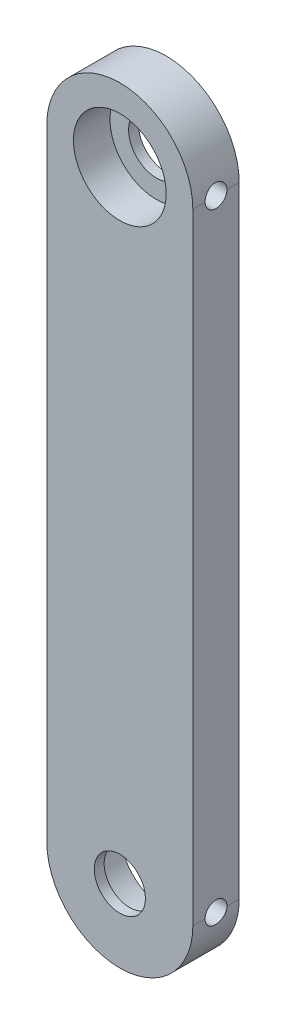
ISO-10303-21;
HEADER;
FILE_DESCRIPTION(('STEP AP214'),'2;1');
FILE_NAME('part.step','',(''),(''),'','','');
FILE_SCHEMA(('AUTOMOTIVE_DESIGN { 1 0 10303 214 1 1 1 1 }'));
ENDSEC;
DATA;
#1=APPLICATION_CONTEXT('core data for automotive mechanical design processes');
#2=APPLICATION_PROTOCOL_DEFINITION('international standard','automotive_design',2000,#1);
#3=PRODUCT_CONTEXT('',#1,'mechanical');
#4=PRODUCT('Part','Part','',(#3));
#5=PRODUCT_RELATED_PRODUCT_CATEGORY('part','',(#4));
#6=PRODUCT_DEFINITION_FORMATION('','',#4);
#7=PRODUCT_DEFINITION_CONTEXT('part definition',#1,'design');
#8=PRODUCT_DEFINITION('design','',#6,#7);
#9=PRODUCT_DEFINITION_SHAPE('','',#8);
#10=(LENGTH_UNIT() NAMED_UNIT(*) SI_UNIT(.MILLI.,.METRE.));
#11=(NAMED_UNIT(*) PLANE_ANGLE_UNIT() SI_UNIT($,.RADIAN.));
#12=(NAMED_UNIT(*) SI_UNIT($,.STERADIAN.) SOLID_ANGLE_UNIT());
#13=UNCERTAINTY_MEASURE_WITH_UNIT(LENGTH_MEASURE(1.E-05),#10,'distance_accuracy_value','');
#14=(GEOMETRIC_REPRESENTATION_CONTEXT(3) GLOBAL_UNCERTAINTY_ASSIGNED_CONTEXT((#13)) GLOBAL_UNIT_ASSIGNED_CONTEXT((#10,
#11,#12)) REPRESENTATION_CONTEXT('',''));
#15=CARTESIAN_POINT('',(0.,0.,0.));
#16=DIRECTION('',(0.,0.,1.));
#17=DIRECTION('',(1.,0.,0.));
#18=AXIS2_PLACEMENT_3D('',#15,#16,#17);
#19=CARTESIAN_POINT('',(0.,42.5,6.35));
#20=DIRECTION('',(0.,0.,-1.));
#21=DIRECTION('',(-1.,0.,0.));
#22=AXIS2_PLACEMENT_3D('',#19,#20,#21);
#23=CYLINDRICAL_SURFACE('',#22,10.);
#24=DIRECTION('',(0.,0.,-1.));
#25=VECTOR('',#24,1.);
#26=CARTESIAN_POINT('',(10.,42.5,6.35));
#27=LINE('',#26,#25);
#28=CARTESIAN_POINT('',(10.,42.5,6.35));
#29=VERTEX_POINT('',#28);
#30=CARTESIAN_POINT('',(10.,42.5,4.675));
#31=VERTEX_POINT('',#30);
#32=EDGE_CURVE('E116',#29,#31,#27,.T.);
#33=ORIENTED_EDGE('',*,*,#32,.T.);
#34=CARTESIAN_POINT('',(10.,42.5,4.675));
#35=CARTESIAN_POINT('',(10.0000014685064,42.5419508736504,4.67499999537497));
#36=CARTESIAN_POINT('',(9.99973568704625,42.5838814247861,4.67323901308362));
#37=CARTESIAN_POINT('',(9.99868521479132,42.6674379610659,4.66621554686748));
#38=CARTESIAN_POINT('',(9.99790056985297,42.709063972796,4.66095337237313));
#39=CARTESIAN_POINT('',(9.99479588619007,42.8329314886251,4.63997389798776));
#40=CARTESIAN_POINT('',(9.99172497314488,42.914336104094,4.61906345213101));
#41=CARTESIAN_POINT('',(9.98391758917327,43.0724284238681,4.56400833880989));
#42=CARTESIAN_POINT('',(9.97918066213689,43.1491148296921,4.52986004691619));
#43=CARTESIAN_POINT('',(9.96856534959666,43.295678956542,4.44931680441856));
#44=CARTESIAN_POINT('',(9.96268699957248,43.3655568890993,4.40292223445846));
#45=CARTESIAN_POINT('',(9.95039202655103,43.4970445259113,4.29882526877398));
#46=CARTESIAN_POINT('',(9.94397197786064,43.5585940245488,4.24104725672947));
#47=CARTESIAN_POINT('',(9.9313432234057,43.6711695622192,4.11597898804128));
#48=CARTESIAN_POINT('',(9.92513455081533,43.7221939557012,4.04868724673824));
#49=CARTESIAN_POINT('',(9.91359860664948,43.8124986952271,3.90609726537435));
#50=CARTESIAN_POINT('',(9.90827581009233,43.8517201783024,3.83076135392111));
#51=CARTESIAN_POINT('',(9.89916189093434,43.9169278188574,3.67448245934921));
#52=CARTESIAN_POINT('',(9.89537059586199,43.9429154667638,3.59354010880837));
#53=CARTESIAN_POINT('',(9.88978259593446,43.980731765885,3.42898294683241));
#54=CARTESIAN_POINT('',(9.88797120063499,43.9926647518175,3.34539262016964));
#55=CARTESIAN_POINT('',(9.88650348181945,44.002356291557,3.17737586593599));
#56=CARTESIAN_POINT('',(9.88684708626085,44.0001153192052,3.09294946640957));
#57=CARTESIAN_POINT('',(9.88963718763456,43.9816073070065,2.92639867029685));
#58=CARTESIAN_POINT('',(9.89206620232456,43.9654568683382,2.84426098127215));
#59=CARTESIAN_POINT('',(9.89872610639239,43.9197709914713,2.68387516321022));
#60=CARTESIAN_POINT('',(9.90295703599484,43.8902352544683,2.60562712104614));
#61=CARTESIAN_POINT('',(9.9127634526375,43.8184953494658,2.45488514064788));
#62=CARTESIAN_POINT('',(9.91834418902924,43.7762415606178,2.38241517319383));
#63=CARTESIAN_POINT('',(9.93021732397089,43.6803019201499,2.2455528505844));
#64=CARTESIAN_POINT('',(9.93650974119488,43.6266157685189,2.18116070747983));
#65=CARTESIAN_POINT('',(9.94917383032146,43.5087036654829,2.06161087632561));
#66=CARTESIAN_POINT('',(9.95554567106682,43.4443788291936,2.00655070165109));
#67=CARTESIAN_POINT('',(9.96759485035053,43.3073265565302,1.90797639950773));
#68=CARTESIAN_POINT('',(9.97327198853175,43.2345967077954,1.86446559874978));
#69=CARTESIAN_POINT('',(9.98329879009977,43.0827046110578,1.79022045732164));
#70=CARTESIAN_POINT('',(9.98764689268088,43.0035349372274,1.75950112360303));
#71=CARTESIAN_POINT('',(9.99450841265943,42.8411362683109,1.7118654141282));
#72=CARTESIAN_POINT('',(9.99702457329285,42.757913542677,1.69492839559142));
#73=CARTESIAN_POINT('',(9.9989901194856,42.6450605368035,1.68174566903024));
#74=CARTESIAN_POINT('',(9.99936853868558,42.6160817227372,1.679214915476));
#75=CARTESIAN_POINT('',(9.99987320258129,42.5580727726573,1.67584431341621));
#76=CARTESIAN_POINT('',(9.99999987181746,42.529042805815,1.67500161822181));
#77=CARTESIAN_POINT('',(10.,42.5,1.675));
#78=B_SPLINE_CURVE_WITH_KNOTS('',3,(#34,#35,#36,#37,#38,#39,#40,#41,#42,#43,#44,#45,#46,#47,#48,
#49,#50,#51,#52,#53,#54,#55,#56,#57,#58,#59,#60,#61,#62,#63,#64,#65,#66,#67,#68,#69,#70,#71,#72,
#73,#74,#75,#76,#77),.UNSPECIFIED.,.F.,.F.,(4,2,2,2,2,2,2,2,2,2,2,2,2,2,2,2,2,2,2,2,2,4),(0.,
0.12577459600247,0.251538077699336,0.502550836025008,0.75363236847621,1.00470609762705,
1.25750755614574,1.5103485090807,1.7644302832657,2.01848343580799,2.27063849496755,
2.52278512452482,2.7728383913245,3.02289724042137,3.27394465404092,3.52499865652247,
3.77853286607112,4.03214002520141,4.28604388366317,4.53956674814969,4.62680426579007,
4.71389454454004),.UNSPECIFIED.);
#79=CARTESIAN_POINT('',(10.,42.5,1.675));
#80=VERTEX_POINT('',#79);
#81=EDGE_CURVE('E65',#31,#80,#78,.T.);
#82=ORIENTED_EDGE('',*,*,#81,.T.);
#83=CARTESIAN_POINT('',(10.,42.5,0.));
#84=VERTEX_POINT('',#83);
#85=EDGE_CURVE('E173',#80,#84,#27,.T.);
#86=ORIENTED_EDGE('',*,*,#85,.T.);
#87=CARTESIAN_POINT('',(0.,42.5,0.));
#88=DIRECTION('',(0.,0.,1.));
#89=DIRECTION('',(1.,0.,0.));
#90=AXIS2_PLACEMENT_3D('',#87,#88,#89);
#91=CIRCLE('',#90,10.);
#92=CARTESIAN_POINT('',(-9.99999999999999,42.5,0.));
#93=VERTEX_POINT('',#92);
#94=EDGE_CURVE('E161',#84,#93,#91,.T.);
#95=ORIENTED_EDGE('',*,*,#94,.T.);
#96=DIRECTION('',(0.,0.,-1.));
#97=VECTOR('',#96,1.);
#98=CARTESIAN_POINT('',(-9.99999999999999,42.5,6.35));
#99=LINE('',#98,#97);
#100=CARTESIAN_POINT('',(-9.99999999999999,42.5,6.35));
#101=VERTEX_POINT('',#100);
#102=EDGE_CURVE('E11',#101,#93,#99,.T.);
#103=ORIENTED_EDGE('',*,*,#102,.F.);
#104=CARTESIAN_POINT('',(0.,42.5,6.35));
#105=DIRECTION('',(0.,0.,1.));
#106=DIRECTION('',(1.,0.,0.));
#107=AXIS2_PLACEMENT_3D('',#104,#105,#106);
#108=CIRCLE('',#107,10.);
#109=EDGE_CURVE('E164',#29,#101,#108,.T.);
#110=ORIENTED_EDGE('',*,*,#109,.F.);
#111=EDGE_LOOP('',(#33,#82,#86,#95,#103,#110));
#112=FACE_BOUND('',#111,.T.);
#113=ADVANCED_FACE('F37',(#112),#23,.T.);
#114=CARTESIAN_POINT('',(-9.99999999999999,42.5,6.35));
#115=DIRECTION('',(1.,0.,0.));
#116=DIRECTION('',(0.,0.,-1.));
#117=AXIS2_PLACEMENT_3D('',#114,#115,#116);
#118=PLANE('',#117);
#119=DIRECTION('',(0.,-1.,0.));
#120=VECTOR('',#119,1.);
#121=CARTESIAN_POINT('',(-9.99999999999999,42.5,0.));
#122=LINE('',#121,#120);
#123=CARTESIAN_POINT('',(-10.,-42.5,0.));
#124=VERTEX_POINT('',#123);
#125=EDGE_CURVE('E176',#93,#124,#122,.T.);
#126=ORIENTED_EDGE('',*,*,#125,.T.);
#127=DIRECTION('',(0.,0.,-1.));
#128=VECTOR('',#127,1.);
#129=CARTESIAN_POINT('',(-10.,-42.5,6.35));
#130=LINE('',#129,#128);
#131=CARTESIAN_POINT('',(-10.,-42.5,6.35));
#132=VERTEX_POINT('',#131);
#133=EDGE_CURVE('E51',#132,#124,#130,.T.);
#134=ORIENTED_EDGE('',*,*,#133,.F.);
#135=DIRECTION('',(0.,-1.,0.));
#136=VECTOR('',#135,1.);
#137=CARTESIAN_POINT('',(-9.99999999999999,42.5,6.35));
#138=LINE('',#137,#136);
#139=EDGE_CURVE('E167',#101,#132,#138,.T.);
#140=ORIENTED_EDGE('',*,*,#139,.F.);
#141=ORIENTED_EDGE('',*,*,#102,.T.);
#142=EDGE_LOOP('',(#126,#134,#140,#141));
#143=FACE_BOUND('',#142,.T.);
#144=ADVANCED_FACE('F223',(#143),#118,.F.);
#145=CARTESIAN_POINT('',(0.,-42.5,6.35));
#146=DIRECTION('',(0.,0.,-1.));
#147=DIRECTION('',(-1.,0.,0.));
#148=AXIS2_PLACEMENT_3D('',#145,#146,#147);
#149=CYLINDRICAL_SURFACE('',#148,10.);
#150=DIRECTION('',(0.,0.,-1.));
#151=VECTOR('',#150,1.);
#152=CARTESIAN_POINT('',(10.,-42.5,6.35));
#153=LINE('',#152,#151);
#154=CARTESIAN_POINT('',(10.,-42.5,1.675));
#155=VERTEX_POINT('',#154);
#156=CARTESIAN_POINT('',(10.,-42.5,0.));
#157=VERTEX_POINT('',#156);
#158=EDGE_CURVE('E107',#155,#157,#153,.T.);
#159=ORIENTED_EDGE('',*,*,#158,.F.);
#160=CARTESIAN_POINT('',(10.,-42.5,1.675));
#161=CARTESIAN_POINT('',(10.0000014685064,-42.5419508736504,1.67500000462503));
#162=CARTESIAN_POINT('',(9.99973568704625,-42.5838814247861,1.67676098691638));
#163=CARTESIAN_POINT('',(9.99868521479133,-42.6674379610659,1.68378445313252));
#164=CARTESIAN_POINT('',(9.99790056985298,-42.709063972796,1.68904662762687));
#165=CARTESIAN_POINT('',(9.99479588619008,-42.8329314886251,1.71002610201224));
#166=CARTESIAN_POINT('',(9.99172497314488,-42.914336104094,1.73093654786898));
#167=CARTESIAN_POINT('',(9.98391758917327,-43.0724284238681,1.78599166119011));
#168=CARTESIAN_POINT('',(9.97918066213689,-43.1491148296921,1.82013995308381));
#169=CARTESIAN_POINT('',(9.96856534959666,-43.295678956542,1.90068319558144));
#170=CARTESIAN_POINT('',(9.96268699957249,-43.3655568890993,1.94707776554154));
#171=CARTESIAN_POINT('',(9.95039202655103,-43.4970445259113,2.05117473122602));
#172=CARTESIAN_POINT('',(9.94397197786064,-43.5585940245488,2.10895274327053));
#173=CARTESIAN_POINT('',(9.93134322340571,-43.6711695622192,2.23402101195872));
#174=CARTESIAN_POINT('',(9.92513455081533,-43.7221939557012,2.30131275326176));
#175=CARTESIAN_POINT('',(9.91359860664949,-43.8124986952271,2.44390273462565));
#176=CARTESIAN_POINT('',(9.90827581009234,-43.8517201783024,2.51923864607889));
#177=CARTESIAN_POINT('',(9.89916189093434,-43.9169278188574,2.67551754065079));
#178=CARTESIAN_POINT('',(9.895370595862,-43.9429154667638,2.75645989119162));
#179=CARTESIAN_POINT('',(9.88978259593446,-43.980731765885,2.92101705316758));
#180=CARTESIAN_POINT('',(9.887971200635,-43.9926647518175,3.00460737983036));
#181=CARTESIAN_POINT('',(9.88650348181946,-44.002356291557,3.17262413406401));
#182=CARTESIAN_POINT('',(9.88684708626086,-44.0001153192052,3.25705053359043));
#183=CARTESIAN_POINT('',(9.88963718763457,-43.9816073070065,3.42360132970315));
#184=CARTESIAN_POINT('',(9.89206620232456,-43.9654568683382,3.50573901872784));
#185=CARTESIAN_POINT('',(9.89872610639239,-43.9197709914713,3.66612483678978));
#186=CARTESIAN_POINT('',(9.90295703599485,-43.8902352544683,3.74437287895386));
#187=CARTESIAN_POINT('',(9.9127634526375,-43.8184953494658,3.89511485935212));
#188=CARTESIAN_POINT('',(9.91834418902924,-43.7762415606178,3.96758482680617));
#189=CARTESIAN_POINT('',(9.9302173239709,-43.6803019201499,4.1044471494156));
#190=CARTESIAN_POINT('',(9.93650974119489,-43.6266157685189,4.16883929252017));
#191=CARTESIAN_POINT('',(9.94917383032147,-43.5087036654829,4.28838912367439));
#192=CARTESIAN_POINT('',(9.95554567106682,-43.4443788291936,4.3434492983489));
#193=CARTESIAN_POINT('',(9.96759485035054,-43.3073265565302,4.44202360049227));
#194=CARTESIAN_POINT('',(9.97327198853176,-43.2345967077954,4.48553440125022));
#195=CARTESIAN_POINT('',(9.98329879009978,-43.0827046110578,4.55977954267836));
#196=CARTESIAN_POINT('',(9.98764689268089,-43.0035349372274,4.59049887639697));
#197=CARTESIAN_POINT('',(9.99450841265944,-42.8411362683109,4.6381345858718));
#198=CARTESIAN_POINT('',(9.99702457329285,-42.757913542677,4.65507160440857));
#199=CARTESIAN_POINT('',(9.99899011948561,-42.6450605368035,4.66825433096976));
#200=CARTESIAN_POINT('',(9.99936853868559,-42.6160817227372,4.670785084524));
#201=CARTESIAN_POINT('',(9.99987320258129,-42.5580727726573,4.67415568658379));
#202=CARTESIAN_POINT('',(9.99999987181746,-42.529042805815,4.67499838177819));
#203=CARTESIAN_POINT('',(10.,-42.5,4.675));
#204=B_SPLINE_CURVE_WITH_KNOTS('',3,(#160,#161,#162,#163,#164,#165,#166,#167,#168,#169,#170,
#171,#172,#173,#174,#175,#176,#177,#178,#179,#180,#181,#182,#183,#184,#185,#186,#187,#188,#189,
#190,#191,#192,#193,#194,#195,#196,#197,#198,#199,#200,#201,#202,#203),.UNSPECIFIED.,.F.,.F.,(4,
2,2,2,2,2,2,2,2,2,2,2,2,2,2,2,2,2,2,2,2,4),(0.,0.12577459600247,0.251538077699336,
0.502550836025008,0.75363236847621,1.00470609762705,1.25750755614574,1.5103485090807,
1.7644302832657,2.01848343580799,2.27063849496754,2.52278512452482,2.7728383913245,
3.02289724042137,3.27394465404091,3.52499865652247,3.77853286607112,4.03214002520141,
4.28604388366317,4.53956674814969,4.62680426579006,4.71389454454004),.UNSPECIFIED.);
#205=CARTESIAN_POINT('',(10.,-42.5,4.675));
#206=VERTEX_POINT('',#205);
#207=EDGE_CURVE('E58',#155,#206,#204,.T.);
#208=ORIENTED_EDGE('',*,*,#207,.T.);
#209=CARTESIAN_POINT('',(10.,-42.5,6.35));
#210=VERTEX_POINT('',#209);
#211=EDGE_CURVE('E104',#210,#206,#153,.T.);
#212=ORIENTED_EDGE('',*,*,#211,.F.);
#213=CARTESIAN_POINT('',(0.,-42.5,6.35));
#214=DIRECTION('',(0.,0.,1.));
#215=DIRECTION('',(1.,0.,0.));
#216=AXIS2_PLACEMENT_3D('',#213,#214,#215);
#217=CIRCLE('',#216,10.);
#218=EDGE_CURVE('E170',#132,#210,#217,.T.);
#219=ORIENTED_EDGE('',*,*,#218,.F.);
#220=ORIENTED_EDGE('',*,*,#133,.T.);
#221=CARTESIAN_POINT('',(0.,-42.5,0.));
#222=DIRECTION('',(0.,0.,1.));
#223=DIRECTION('',(1.,0.,0.));
#224=AXIS2_PLACEMENT_3D('',#221,#222,#223);
#225=CIRCLE('',#224,10.);
#226=EDGE_CURVE('E178',#124,#157,#225,.T.);
#227=ORIENTED_EDGE('',*,*,#226,.T.);
#228=EDGE_LOOP('',(#159,#208,#212,#219,#220,#227));
#229=FACE_BOUND('',#228,.T.);
#230=ADVANCED_FACE('F102',(#229),#149,.T.);
#231=CARTESIAN_POINT('',(10.,42.5,6.35));
#232=DIRECTION('',(-1.,0.,0.));
#233=DIRECTION('',(0.,0.,1.));
#234=AXIS2_PLACEMENT_3D('',#231,#232,#233);
#235=PLANE('',#234);
#236=ORIENTED_EDGE('',*,*,#211,.T.);
#237=CARTESIAN_POINT('',(10.,-42.5,3.175));
#238=DIRECTION('',(1.,0.,0.));
#239=DIRECTION('',(0.,0.,-1.));
#240=AXIS2_PLACEMENT_3D('',#237,#238,#239);
#241=CIRCLE('',#240,1.5);
#242=EDGE_CURVE('E94',#155,#206,#241,.T.);
#243=ORIENTED_EDGE('',*,*,#242,.F.);
#244=ORIENTED_EDGE('',*,*,#158,.T.);
#245=DIRECTION('',(0.,1.,0.));
#246=VECTOR('',#245,1.);
#247=CARTESIAN_POINT('',(10.,42.5,0.));
#248=LINE('',#247,#246);
#249=EDGE_CURVE('E168',#157,#84,#248,.T.);
#250=ORIENTED_EDGE('',*,*,#249,.T.);
#251=ORIENTED_EDGE('',*,*,#85,.F.);
#252=CARTESIAN_POINT('',(10.,42.5,3.175));
#253=DIRECTION('',(1.,0.,0.));
#254=DIRECTION('',(0.,0.,-1.));
#255=AXIS2_PLACEMENT_3D('',#252,#253,#254);
#256=CIRCLE('',#255,1.5);
#257=EDGE_CURVE('E127',#31,#80,#256,.T.);
#258=ORIENTED_EDGE('',*,*,#257,.F.);
#259=ORIENTED_EDGE('',*,*,#32,.F.);
#260=DIRECTION('',(0.,1.,0.));
#261=VECTOR('',#260,1.);
#262=CARTESIAN_POINT('',(10.,42.5,6.35));
#263=LINE('',#262,#261);
#264=EDGE_CURVE('E112',#210,#29,#263,.T.);
#265=ORIENTED_EDGE('',*,*,#264,.F.);
#266=EDGE_LOOP('',(#236,#243,#244,#250,#251,#258,#259,#265));
#267=FACE_BOUND('',#266,.T.);
#268=ADVANCED_FACE('F110',(#267),#235,.F.);
#269=CARTESIAN_POINT('',(0.,42.5,6.35));
#270=DIRECTION('',(0.,0.,1.));
#271=DIRECTION('',(1.,0.,0.));
#272=AXIS2_PLACEMENT_3D('',#269,#270,#271);
#273=PLANE('',#272);
#274=CARTESIAN_POINT('',(0.,-42.5,6.35));
#275=DIRECTION('',(0.,0.,1.));
#276=DIRECTION('',(1.,0.,0.));
#277=AXIS2_PLACEMENT_3D('',#274,#275,#276);
#278=CIRCLE('',#277,3.5);
#279=CARTESIAN_POINT('',(3.5,-42.5,6.35));
#280=VERTEX_POINT('',#279);
#281=EDGE_CURVE('E128',#280,#280,#278,.T.);
#282=ORIENTED_EDGE('',*,*,#281,.F.);
#283=EDGE_LOOP('',(#282));
#284=FACE_BOUND('',#283,.T.);
#285=CARTESIAN_POINT('',(0.,42.5,6.35));
#286=DIRECTION('',(0.,0.,1.));
#287=DIRECTION('',(1.,0.,0.));
#288=AXIS2_PLACEMENT_3D('',#285,#286,#287);
#289=CIRCLE('',#288,6.35);
#290=CARTESIAN_POINT('',(6.35,42.5,6.35));
#291=VERTEX_POINT('',#290);
#292=EDGE_CURVE('E155',#291,#291,#289,.T.);
#293=ORIENTED_EDGE('',*,*,#292,.F.);
#294=EDGE_LOOP('',(#293));
#295=FACE_BOUND('',#294,.T.);
#296=ORIENTED_EDGE('',*,*,#109,.T.);
#297=ORIENTED_EDGE('',*,*,#139,.T.);
#298=ORIENTED_EDGE('',*,*,#218,.T.);
#299=ORIENTED_EDGE('',*,*,#264,.T.);
#300=EDGE_LOOP('',(#296,#297,#298,#299));
#301=FACE_BOUND('',#300,.T.);
#302=ADVANCED_FACE('F233',(#284,#295,#301),#273,.T.);
#303=CARTESIAN_POINT('',(0.,42.5,0.));
#304=DIRECTION('',(0.,0.,1.));
#305=DIRECTION('',(1.,0.,0.));
#306=AXIS2_PLACEMENT_3D('',#303,#304,#305);
#307=PLANE('',#306);
#308=CARTESIAN_POINT('',(0.,-42.5,0.));
#309=DIRECTION('',(0.,0.,-1.));
#310=DIRECTION('',(-1.,0.,0.));
#311=AXIS2_PLACEMENT_3D('',#308,#309,#310);
#312=CIRCLE('',#311,6.35);
#313=CARTESIAN_POINT('',(-6.35,-42.5,0.));
#314=VERTEX_POINT('',#313);
#315=EDGE_CURVE('E192',#314,#314,#312,.T.);
#316=ORIENTED_EDGE('',*,*,#315,.F.);
#317=EDGE_LOOP('',(#316));
#318=FACE_BOUND('',#317,.T.);
#319=CARTESIAN_POINT('',(0.,42.5,0.));
#320=DIRECTION('',(0.,0.,1.));
#321=DIRECTION('',(1.,0.,0.));
#322=AXIS2_PLACEMENT_3D('',#319,#320,#321);
#323=CIRCLE('',#322,3.8);
#324=CARTESIAN_POINT('',(3.8,42.5,0.));
#325=VERTEX_POINT('',#324);
#326=EDGE_CURVE('E152',#325,#325,#323,.T.);
#327=ORIENTED_EDGE('',*,*,#326,.T.);
#328=EDGE_LOOP('',(#327));
#329=FACE_BOUND('',#328,.T.);
#330=ORIENTED_EDGE('',*,*,#94,.F.);
#331=ORIENTED_EDGE('',*,*,#249,.F.);
#332=ORIENTED_EDGE('',*,*,#226,.F.);
#333=ORIENTED_EDGE('',*,*,#125,.F.);
#334=EDGE_LOOP('',(#330,#331,#332,#333));
#335=FACE_BOUND('',#334,.T.);
#336=ADVANCED_FACE('F185',(#318,#329,#335),#307,.F.);
#337=CARTESIAN_POINT('',(0.,42.5,1.35));
#338=DIRECTION('',(0.,0.,1.));
#339=DIRECTION('',(1.,0.,0.));
#340=AXIS2_PLACEMENT_3D('',#337,#338,#339);
#341=CYLINDRICAL_SURFACE('',#340,6.35);
#342=CARTESIAN_POINT('',(6.35,42.5,1.675));
#343=CARTESIAN_POINT('',(6.34999851724394,42.5830209487421,1.67500257688155));
#344=CARTESIAN_POINT('',(6.34835548464635,42.6660717055425,1.68191570943469));
#345=CARTESIAN_POINT('',(6.34196006203194,42.8298026167738,1.70934998922864));
#346=CARTESIAN_POINT('',(6.33720570059271,42.9104812342622,1.72987976445553));
#347=CARTESIAN_POINT('',(6.32511541536285,43.067078972002,1.78385930734222));
#348=CARTESIAN_POINT('',(6.31778241043488,43.1430033597441,1.8172944710726));
#349=CARTESIAN_POINT('',(6.3013205537597,43.2881641285173,1.89608655368896));
#350=CARTESIAN_POINT('',(6.29219168938456,43.3574004625148,1.94144355640646));
#351=CARTESIAN_POINT('',(6.27294410619427,43.4885041460754,2.04368053942395));
#352=CARTESIAN_POINT('',(6.26281145281054,43.5502298306782,2.10073957298259));
#353=CARTESIAN_POINT('',(6.24279339171245,43.6633300796207,2.22437709118983));
#354=CARTESIAN_POINT('',(6.23290800919792,43.7147035926849,2.2909565414756));
#355=CARTESIAN_POINT('',(6.21436474587977,43.8062885785891,2.43282095444811));
#356=CARTESIAN_POINT('',(6.20572463411778,43.8463450769596,2.50820849776783));
#357=CARTESIAN_POINT('',(6.19085199880808,43.9131635374986,2.6648836012136));
#358=CARTESIAN_POINT('',(6.18461913528441,43.9399273771435,2.74617032626984));
#359=CARTESIAN_POINT('',(6.1754093638889,43.9789243640839,2.91078791256923));
#360=CARTESIAN_POINT('',(6.17237584620283,43.9914104910839,2.99405560628802));
#361=CARTESIAN_POINT('',(6.16973853210433,44.0022850018873,3.16155484676636));
#362=CARTESIAN_POINT('',(6.17013424074104,44.0006754201675,3.24578625267775));
#363=CARTESIAN_POINT('',(6.17425961423211,43.9836068356708,3.41090996101587));
#364=CARTESIAN_POINT('',(6.17791755158493,43.9684457767716,3.49183512949749));
#365=CARTESIAN_POINT('',(6.18804133190496,43.9251784049009,3.64995972740285));
#366=CARTESIAN_POINT('',(6.19450735566558,43.8970712584127,3.72715891658072));
#367=CARTESIAN_POINT('',(6.20958678218059,43.8284467845848,3.87645664379614));
#368=CARTESIAN_POINT('',(6.218219265795,43.7878184115154,3.94850213199462));
#369=CARTESIAN_POINT('',(6.23664776102025,43.6953826164008,4.08486136281563));
#370=CARTESIAN_POINT('',(6.24644395581355,43.6435734333074,4.14917388495947));
#371=CARTESIAN_POINT('',(6.26640074159939,43.5286879051709,4.26995273495692));
#372=CARTESIAN_POINT('',(6.27656427474605,43.4653592290764,4.32617883022869));
#373=CARTESIAN_POINT('',(6.29588562944103,43.3300525364603,4.42725550259073));
#374=CARTESIAN_POINT('',(6.30504342639666,43.2580743085263,4.47210580155035));
#375=CARTESIAN_POINT('',(6.32135942493142,43.1071916141095,4.54923262841604));
#376=CARTESIAN_POINT('',(6.32851195395597,43.0282683124554,4.58147358631544));
#377=CARTESIAN_POINT('',(6.33996993682454,42.8659165605986,4.63216630266991));
#378=CARTESIAN_POINT('',(6.3442758753518,42.7824888799654,4.65062040865422));
#379=CARTESIAN_POINT('',(6.34948503249582,42.6155535389804,4.67285668601183));
#380=CARTESIAN_POINT('',(6.35046421324578,42.5320918238016,4.6769664522477));
#381=CARTESIAN_POINT('',(6.3491242902122,42.3656739204676,4.67129106790022));
#382=CARTESIAN_POINT('',(6.34680544961474,42.2827176925044,4.66150702605959));
#383=CARTESIAN_POINT('',(6.33917838174839,42.1207798301404,4.62859261840112));
#384=CARTESIAN_POINT('',(6.33390950352625,42.0417604890031,4.60563783257741));
#385=CARTESIAN_POINT('',(6.3209740002995,41.8886959136126,4.54723149966577));
#386=CARTESIAN_POINT('',(6.31330714919518,41.8146511492018,4.51177877413379));
#387=CARTESIAN_POINT('',(6.29624149651372,41.672310695681,4.4287264483997));
#388=CARTESIAN_POINT('',(6.28681663475877,41.604127654475,4.38093926429423));
#389=CARTESIAN_POINT('',(6.2673266811016,41.4766314517236,4.27481752950993));
#390=CARTESIAN_POINT('',(6.25726149136241,41.4173196502941,4.21648136451076));
#391=CARTESIAN_POINT('',(6.23735679650375,41.3079241957992,4.08940401687873));
#392=CARTESIAN_POINT('',(6.22752694929492,41.2580690961075,4.02046426640514));
#393=CARTESIAN_POINT('',(6.20945265145426,41.1706397078834,3.87500057804812));
#394=CARTESIAN_POINT('',(6.2012081299286,41.1330648701401,3.7984769795371));
#395=CARTESIAN_POINT('',(6.1873240848113,41.0715336346671,3.64043566793411));
#396=CARTESIAN_POINT('',(6.18166930794986,41.047497298881,3.5589504859383));
#397=CARTESIAN_POINT('',(6.17358371023306,41.0135023808069,3.39294412141734));
#398=CARTESIAN_POINT('',(6.17115227288946,41.0035411065321,3.30842352261579));
#399=CARTESIAN_POINT('',(6.16983199335337,40.9981081090918,3.14106112146151));
#400=CARTESIAN_POINT('',(6.1708541839276,41.0022725122384,3.05823163293272));
#401=CARTESIAN_POINT('',(6.17612233302334,41.0241486824006,2.89449127444565));
#402=CARTESIAN_POINT('',(6.18036823966433,41.0418602313968,2.81358037363241));
#403=CARTESIAN_POINT('',(6.19155859321836,41.0901393302196,2.65632098353121));
#404=CARTESIAN_POINT('',(6.19849016148399,41.120645581895,2.57995269713613));
#405=CARTESIAN_POINT('',(6.21427398682872,41.1935982482732,2.43336716284176));
#406=CARTESIAN_POINT('',(6.2231264810561,41.2360461374252,2.36315067591788));
#407=CARTESIAN_POINT('',(6.24201391004487,41.3328479374515,2.22908721321493));
#408=CARTESIAN_POINT('',(6.25207168946106,41.3874575011935,2.1654280187217));
#409=CARTESIAN_POINT('',(6.27209257501467,41.5065250551108,2.0480583428238));
#410=CARTESIAN_POINT('',(6.2820556584478,41.5709853468298,1.99435019290582));
#411=CARTESIAN_POINT('',(6.30095070373692,41.7091449224679,1.8975916638141));
#412=CARTESIAN_POINT('',(6.30986403352164,41.7829733035021,1.85472173683658));
#413=CARTESIAN_POINT('',(6.32546353967865,41.936988746183,1.78206930320467));
#414=CARTESIAN_POINT('',(6.33215143699731,42.0171708347603,1.752276678042));
#415=CARTESIAN_POINT('',(6.34146337323501,42.1644312976428,1.71145636515545));
#416=CARTESIAN_POINT('',(6.34464362420469,42.2307618976541,1.69781315294047));
#417=CARTESIAN_POINT('',(6.34891247920239,42.3647217864704,1.67958419109222));
#418=CARTESIAN_POINT('',(6.35000120821274,42.4323509974308,1.67499790024723));
#419=CARTESIAN_POINT('',(6.35,42.5,1.675));
#420=B_SPLINE_CURVE_WITH_KNOTS('',3,(#342,#343,#344,#345,#346,#347,#348,#349,#350,#351,#352,
#353,#354,#355,#356,#357,#358,#359,#360,#361,#362,#363,#364,#365,#366,#367,#368,#369,#370,#371,
#372,#373,#374,#375,#376,#377,#378,#379,#380,#381,#382,#383,#384,#385,#386,#387,#388,#389,#390,
#391,#392,#393,#394,#395,#396,#397,#398,#399,#400,#401,#402,#403,#404,#405,#406,#407,#408,#409,
#410,#411,#412,#413,#414,#415,#416,#417,#418,#419),.UNSPECIFIED.,.T.,.F.,(4,2,2,2,2,2,2,2,2,2,2,
2,2,2,2,2,2,2,2,2,2,2,2,2,2,2,2,2,2,2,2,2,2,2,2,2,2,2,4),(0.,0.248815070913742,
0.497787950658723,0.746479911109816,0.995173620349725,1.24800235932538,1.50085676043726,
1.75702225097101,2.01315154998107,2.26466865776917,2.51614946391932,2.76223359968085,
3.00833358145962,3.25668218758358,3.50506993876883,3.75975438391661,4.01444505532947,
4.26984909538289,4.52520963709547,4.77469868586512,5.02416782622496,5.27038608564858,
5.51662756746636,5.76686059612936,6.01713195064178,6.2728421065447,6.52854082474265,
6.78271350366646,7.0368375631117,7.28446569177386,7.53208983534431,7.7785409483085,
8.02502250427131,8.2772790529975,8.5295946298092,8.78586924469398,9.04194521710613,
9.24470244341197,9.44744755324905),.UNSPECIFIED.);
#421=CARTESIAN_POINT('',(6.35,42.5,1.675));
#422=VERTEX_POINT('',#421);
#423=EDGE_CURVE('E120',#422,#422,#420,.T.);
#424=ORIENTED_EDGE('',*,*,#423,.T.);
#425=EDGE_LOOP('',(#424));
#426=FACE_BOUND('',#425,.T.);
#427=CARTESIAN_POINT('',(0.,42.5,1.35));
#428=DIRECTION('',(0.,0.,1.));
#429=DIRECTION('',(1.,0.,0.));
#430=AXIS2_PLACEMENT_3D('',#427,#428,#429);
#431=CIRCLE('',#430,6.35);
#432=CARTESIAN_POINT('',(6.35,42.5,1.35));
#433=VERTEX_POINT('',#432);
#434=EDGE_CURVE('E158',#433,#433,#431,.T.);
#435=ORIENTED_EDGE('',*,*,#434,.F.);
#436=EDGE_LOOP('',(#435));
#437=FACE_BOUND('',#436,.T.);
#438=ORIENTED_EDGE('',*,*,#292,.T.);
#439=EDGE_LOOP('',(#438));
#440=FACE_BOUND('',#439,.T.);
#441=ADVANCED_FACE('F129',(#426,#437,#440),#341,.F.);
#442=CARTESIAN_POINT('',(0.,42.5,1.35));
#443=DIRECTION('',(0.,0.,1.));
#444=DIRECTION('',(1.,0.,0.));
#445=AXIS2_PLACEMENT_3D('',#442,#443,#444);
#446=PLANE('',#445);
#447=CARTESIAN_POINT('',(0.,42.5,1.35));
#448=DIRECTION('',(0.,0.,1.));
#449=DIRECTION('',(1.,0.,0.));
#450=AXIS2_PLACEMENT_3D('',#447,#448,#449);
#451=CIRCLE('',#450,3.8);
#452=CARTESIAN_POINT('',(3.8,42.5,1.35));
#453=VERTEX_POINT('',#452);
#454=EDGE_CURVE('E150',#453,#453,#451,.T.);
#455=ORIENTED_EDGE('',*,*,#454,.F.);
#456=EDGE_LOOP('',(#455));
#457=FACE_BOUND('',#456,.T.);
#458=ORIENTED_EDGE('',*,*,#434,.T.);
#459=EDGE_LOOP('',(#458));
#460=FACE_BOUND('',#459,.T.);
#461=ADVANCED_FACE('F248',(#457,#460),#446,.T.);
#462=CARTESIAN_POINT('',(0.,42.5,0.));
#463=DIRECTION('',(0.,0.,1.));
#464=DIRECTION('',(1.,0.,0.));
#465=AXIS2_PLACEMENT_3D('',#462,#463,#464);
#466=CYLINDRICAL_SURFACE('',#465,3.8);
#467=ORIENTED_EDGE('',*,*,#326,.F.);
#468=EDGE_LOOP('',(#467));
#469=FACE_BOUND('',#468,.T.);
#470=ORIENTED_EDGE('',*,*,#454,.T.);
#471=EDGE_LOOP('',(#470));
#472=FACE_BOUND('',#471,.T.);
#473=ADVANCED_FACE('F138',(#469,#472),#466,.F.);
#474=CARTESIAN_POINT('',(5.00000000000002,42.5,3.175));
#475=DIRECTION('',(1.,0.,0.));
#476=DIRECTION('',(0.,0.,-1.));
#477=AXIS2_PLACEMENT_3D('',#474,#475,#476);
#478=CYLINDRICAL_SURFACE('',#477,1.5);
#479=ORIENTED_EDGE('',*,*,#423,.F.);
#480=EDGE_LOOP('',(#479));
#481=FACE_BOUND('',#480,.T.);
#482=ORIENTED_EDGE('',*,*,#257,.T.);
#483=ORIENTED_EDGE('',*,*,#81,.F.);
#484=EDGE_LOOP('',(#482,#483));
#485=FACE_BOUND('',#484,.T.);
#486=ADVANCED_FACE('F133',(#481,#485),#478,.F.);
#487=CARTESIAN_POINT('',(0.,-42.5,5.));
#488=DIRECTION('',(0.,0.,-1.));
#489=DIRECTION('',(-1.,0.,0.));
#490=AXIS2_PLACEMENT_3D('',#487,#488,#489);
#491=CYLINDRICAL_SURFACE('',#490,6.35);
#492=CARTESIAN_POINT('',(6.35,-42.5,1.675));
#493=CARTESIAN_POINT('',(6.34999851724395,-42.4169790512579,1.67500257688155));
#494=CARTESIAN_POINT('',(6.34835548464635,-42.3339282944575,1.68191570943469));
#495=CARTESIAN_POINT('',(6.34196006203195,-42.1701973832262,1.70934998922864));
#496=CARTESIAN_POINT('',(6.33720570059271,-42.0895187657378,1.72987976445553));
#497=CARTESIAN_POINT('',(6.32511541536286,-41.932921027998,1.78385930734222));
#498=CARTESIAN_POINT('',(6.31778241043488,-41.8569966402559,1.8172944710726));
#499=CARTESIAN_POINT('',(6.3013205537597,-41.7118358714827,1.89608655368896));
#500=CARTESIAN_POINT('',(6.29219168938457,-41.6425995374852,1.94144355640646));
#501=CARTESIAN_POINT('',(6.27294410619427,-41.5114958539246,2.04368053942395));
#502=CARTESIAN_POINT('',(6.26281145281055,-41.4497701693217,2.10073957298259));
#503=CARTESIAN_POINT('',(6.24279339171245,-41.3366699203793,2.22437709118983));
#504=CARTESIAN_POINT('',(6.23290800919793,-41.2852964073151,2.2909565414756));
#505=CARTESIAN_POINT('',(6.21436474587978,-41.1937114214109,2.43282095444811));
#506=CARTESIAN_POINT('',(6.20572463411779,-41.1536549230404,2.50820849776783));
#507=CARTESIAN_POINT('',(6.19085199880808,-41.0868364625014,2.6648836012136));
#508=CARTESIAN_POINT('',(6.18461913528442,-41.0600726228565,2.74617032626984));
#509=CARTESIAN_POINT('',(6.1754093638889,-41.0210756359161,2.91078791256923));
#510=CARTESIAN_POINT('',(6.17237584620284,-41.0085895089161,2.99405560628802));
#511=CARTESIAN_POINT('',(6.16973853210434,-40.9977149981127,3.16155484676636));
#512=CARTESIAN_POINT('',(6.17013424074105,-40.9993245798325,3.24578625267775));
#513=CARTESIAN_POINT('',(6.17425961423211,-41.0163931643292,3.41090996101587));
#514=CARTESIAN_POINT('',(6.17791755158493,-41.0315542232284,3.49183512949749));
#515=CARTESIAN_POINT('',(6.18804133190497,-41.0748215950991,3.64995972740285));
#516=CARTESIAN_POINT('',(6.19450735566558,-41.1029287415873,3.72715891658072));
#517=CARTESIAN_POINT('',(6.20958678218059,-41.1715532154152,3.87645664379614));
#518=CARTESIAN_POINT('',(6.21821926579501,-41.2121815884846,3.94850213199462));
#519=CARTESIAN_POINT('',(6.23664776102025,-41.3046173835992,4.08486136281563));
#520=CARTESIAN_POINT('',(6.24644395581355,-41.3564265666926,4.14917388495947));
#521=CARTESIAN_POINT('',(6.26640074159939,-41.4713120948291,4.26995273495692));
#522=CARTESIAN_POINT('',(6.27656427474606,-41.5346407709236,4.32617883022869));
#523=CARTESIAN_POINT('',(6.29588562944104,-41.6699474635397,4.42725550259073));
#524=CARTESIAN_POINT('',(6.30504342639666,-41.7419256914737,4.47210580155035));
#525=CARTESIAN_POINT('',(6.32135942493142,-41.8928083858905,4.54923262841604));
#526=CARTESIAN_POINT('',(6.32851195395597,-41.9717316875446,4.58147358631544));
#527=CARTESIAN_POINT('',(6.33996993682454,-42.1340834394014,4.63216630266991));
#528=CARTESIAN_POINT('',(6.34427587535181,-42.2175111200346,4.65062040865422));
#529=CARTESIAN_POINT('',(6.34948503249582,-42.3844464610196,4.67285668601183));
#530=CARTESIAN_POINT('',(6.35046421324579,-42.4679081761983,4.6769664522477));
#531=CARTESIAN_POINT('',(6.34912429021221,-42.6343260795323,4.67129106790022));
#532=CARTESIAN_POINT('',(6.34680544961474,-42.7172823074956,4.66150702605959));
#533=CARTESIAN_POINT('',(6.33917838174839,-42.8792201698596,4.62859261840112));
#534=CARTESIAN_POINT('',(6.33390950352625,-42.9582395109969,4.60563783257741));
#535=CARTESIAN_POINT('',(6.32097400029951,-43.1113040863873,4.54723149966577));
#536=CARTESIAN_POINT('',(6.31330714919518,-43.1853488507982,4.51177877413379));
#537=CARTESIAN_POINT('',(6.29624149651373,-43.327689304319,4.4287264483997));
#538=CARTESIAN_POINT('',(6.28681663475878,-43.395872345525,4.38093926429423));
#539=CARTESIAN_POINT('',(6.26732668110161,-43.5233685482764,4.27481752950994));
#540=CARTESIAN_POINT('',(6.25726149136242,-43.5826803497059,4.21648136451076));
#541=CARTESIAN_POINT('',(6.23735679650375,-43.6920758042008,4.08940401687873));
#542=CARTESIAN_POINT('',(6.22752694929493,-43.7419309038925,4.02046426640514));
#543=CARTESIAN_POINT('',(6.20945265145426,-43.8293602921166,3.87500057804812));
#544=CARTESIAN_POINT('',(6.2012081299286,-43.8669351298599,3.7984769795371));
#545=CARTESIAN_POINT('',(6.18732408481131,-43.9284663653329,3.64043566793411));
#546=CARTESIAN_POINT('',(6.18166930794986,-43.952502701119,3.5589504859383));
#547=CARTESIAN_POINT('',(6.17358371023306,-43.9864976191931,3.39294412141734));
#548=CARTESIAN_POINT('',(6.17115227288946,-43.9964588934679,3.30842352261579));
#549=CARTESIAN_POINT('',(6.16983199335337,-44.0018918909082,3.14106112146151));
#550=CARTESIAN_POINT('',(6.1708541839276,-43.9977274877616,3.05823163293272));
#551=CARTESIAN_POINT('',(6.17612233302335,-43.9758513175994,2.89449127444565));
#552=CARTESIAN_POINT('',(6.18036823966433,-43.9581397686032,2.81358037363241));
#553=CARTESIAN_POINT('',(6.19155859321836,-43.9098606697804,2.65632098353121));
#554=CARTESIAN_POINT('',(6.198490161484,-43.879354418105,2.57995269713613));
#555=CARTESIAN_POINT('',(6.21427398682872,-43.8064017517268,2.43336716284176));
#556=CARTESIAN_POINT('',(6.22312648105611,-43.7639538625748,2.36315067591788));
#557=CARTESIAN_POINT('',(6.24201391004487,-43.6671520625485,2.22908721321493));
#558=CARTESIAN_POINT('',(6.25207168946107,-43.6125424988065,2.1654280187217));
#559=CARTESIAN_POINT('',(6.27209257501468,-43.4934749448892,2.0480583428238));
#560=CARTESIAN_POINT('',(6.28205565844781,-43.4290146531702,1.99435019290582));
#561=CARTESIAN_POINT('',(6.30095070373692,-43.2908550775321,1.8975916638141));
#562=CARTESIAN_POINT('',(6.30986403352165,-43.2170266964979,1.85472173683658));
#563=CARTESIAN_POINT('',(6.32546353967866,-43.063011253817,1.78206930320467));
#564=CARTESIAN_POINT('',(6.33215143699731,-42.9828291652397,1.752276678042));
#565=CARTESIAN_POINT('',(6.34146337323501,-42.8355687023572,1.71145636515545));
#566=CARTESIAN_POINT('',(6.3446436242047,-42.7692381023459,1.69781315294047));
#567=CARTESIAN_POINT('',(6.34891247920239,-42.6352782135296,1.67958419109222));
#568=CARTESIAN_POINT('',(6.35000120821274,-42.5676490025692,1.67499790024723));
#569=CARTESIAN_POINT('',(6.35,-42.5,1.675));
#570=B_SPLINE_CURVE_WITH_KNOTS('',3,(#492,#493,#494,#495,#496,#497,#498,#499,#500,#501,#502,
#503,#504,#505,#506,#507,#508,#509,#510,#511,#512,#513,#514,#515,#516,#517,#518,#519,#520,#521,
#522,#523,#524,#525,#526,#527,#528,#529,#530,#531,#532,#533,#534,#535,#536,#537,#538,#539,#540,
#541,#542,#543,#544,#545,#546,#547,#548,#549,#550,#551,#552,#553,#554,#555,#556,#557,#558,#559,
#560,#561,#562,#563,#564,#565,#566,#567,#568,#569),.UNSPECIFIED.,.T.,.F.,(4,2,2,2,2,2,2,2,2,2,2,
2,2,2,2,2,2,2,2,2,2,2,2,2,2,2,2,2,2,2,2,2,2,2,2,2,2,2,4),(0.,0.248815070913742,
0.497787950658723,0.746479911109816,0.995173620349725,1.24800235932538,1.50085676043726,
1.75702225097101,2.01315154998107,2.26466865776917,2.51614946391932,2.76223359968085,
3.00833358145962,3.25668218758358,3.50506993876883,3.75975438391661,4.01444505532947,
4.26984909538289,4.52520963709547,4.77469868586512,5.02416782622496,5.27038608564858,
5.51662756746636,5.76686059612936,6.01713195064178,6.2728421065447,6.52854082474265,
6.78271350366646,7.0368375631117,7.28446569177386,7.53208983534431,7.7785409483085,
8.02502250427131,8.2772790529975,8.5295946298092,8.78586924469397,9.04194521710613,
9.24470244341197,9.44744755324906),.UNSPECIFIED.);
#571=CARTESIAN_POINT('',(6.35,-42.5,1.675));
#572=VERTEX_POINT('',#571);
#573=EDGE_CURVE('E41',#572,#572,#570,.T.);
#574=ORIENTED_EDGE('',*,*,#573,.T.);
#575=EDGE_LOOP('',(#574));
#576=FACE_BOUND('',#575,.T.);
#577=CARTESIAN_POINT('',(0.,-42.5,5.));
#578=DIRECTION('',(0.,0.,-1.));
#579=DIRECTION('',(-1.,0.,0.));
#580=AXIS2_PLACEMENT_3D('',#577,#578,#579);
#581=CIRCLE('',#580,6.35);
#582=CARTESIAN_POINT('',(-6.35,-42.5,5.));
#583=VERTEX_POINT('',#582);
#584=EDGE_CURVE('E190',#583,#583,#581,.T.);
#585=ORIENTED_EDGE('',*,*,#584,.F.);
#586=EDGE_LOOP('',(#585));
#587=FACE_BOUND('',#586,.T.);
#588=ORIENTED_EDGE('',*,*,#315,.T.);
#589=EDGE_LOOP('',(#588));
#590=FACE_BOUND('',#589,.T.);
#591=ADVANCED_FACE('F137',(#576,#587,#590),#491,.F.);
#592=CARTESIAN_POINT('',(0.,-42.5,5.));
#593=DIRECTION('',(0.,0.,-1.));
#594=DIRECTION('',(-1.,0.,0.));
#595=AXIS2_PLACEMENT_3D('',#592,#593,#594);
#596=PLANE('',#595);
#597=CARTESIAN_POINT('',(0.,-42.5,5.));
#598=DIRECTION('',(0.,0.,-1.));
#599=DIRECTION('',(-1.,0.,0.));
#600=AXIS2_PLACEMENT_3D('',#597,#598,#599);
#601=CIRCLE('',#600,3.5);
#602=CARTESIAN_POINT('',(-3.5,-42.5,5.));
#603=VERTEX_POINT('',#602);
#604=EDGE_CURVE('E108',#603,#603,#601,.T.);
#605=ORIENTED_EDGE('',*,*,#604,.F.);
#606=EDGE_LOOP('',(#605));
#607=FACE_BOUND('',#606,.T.);
#608=ORIENTED_EDGE('',*,*,#584,.T.);
#609=EDGE_LOOP('',(#608));
#610=FACE_BOUND('',#609,.T.);
#611=ADVANCED_FACE('F213',(#607,#610),#596,.T.);
#612=CARTESIAN_POINT('',(0.,-42.5,10.));
#613=DIRECTION('',(0.,0.,-1.));
#614=DIRECTION('',(-1.,0.,0.));
#615=AXIS2_PLACEMENT_3D('',#612,#613,#614);
#616=CYLINDRICAL_SURFACE('',#615,3.5);
#617=ORIENTED_EDGE('',*,*,#281,.T.);
#618=EDGE_LOOP('',(#617));
#619=FACE_BOUND('',#618,.T.);
#620=ORIENTED_EDGE('',*,*,#604,.T.);
#621=EDGE_LOOP('',(#620));
#622=FACE_BOUND('',#621,.T.);
#623=ADVANCED_FACE('F209',(#619,#622),#616,.F.);
#624=CARTESIAN_POINT('',(5.00000000000002,-42.5,3.175));
#625=DIRECTION('',(1.,0.,0.));
#626=DIRECTION('',(0.,0.,-1.));
#627=AXIS2_PLACEMENT_3D('',#624,#625,#626);
#628=CYLINDRICAL_SURFACE('',#627,1.5);
#629=ORIENTED_EDGE('',*,*,#573,.F.);
#630=EDGE_LOOP('',(#629));
#631=FACE_BOUND('',#630,.T.);
#632=ORIENTED_EDGE('',*,*,#242,.T.);
#633=ORIENTED_EDGE('',*,*,#207,.F.);
#634=EDGE_LOOP('',(#632,#633));
#635=FACE_BOUND('',#634,.T.);
#636=ADVANCED_FACE('F95',(#631,#635),#628,.F.);
#637=CLOSED_SHELL('',(#113,#144,#230,#268,#302,#336,#441,#461,#473,#486,#591,#611,#623,#636));
#638=MANIFOLD_SOLID_BREP('B2',#637);
#639=ADVANCED_BREP_SHAPE_REPRESENTATION('',(#18,#638),#14);
#640=SHAPE_DEFINITION_REPRESENTATION(#9,#639);
ENDSEC;
END-ISO-10303-21;
